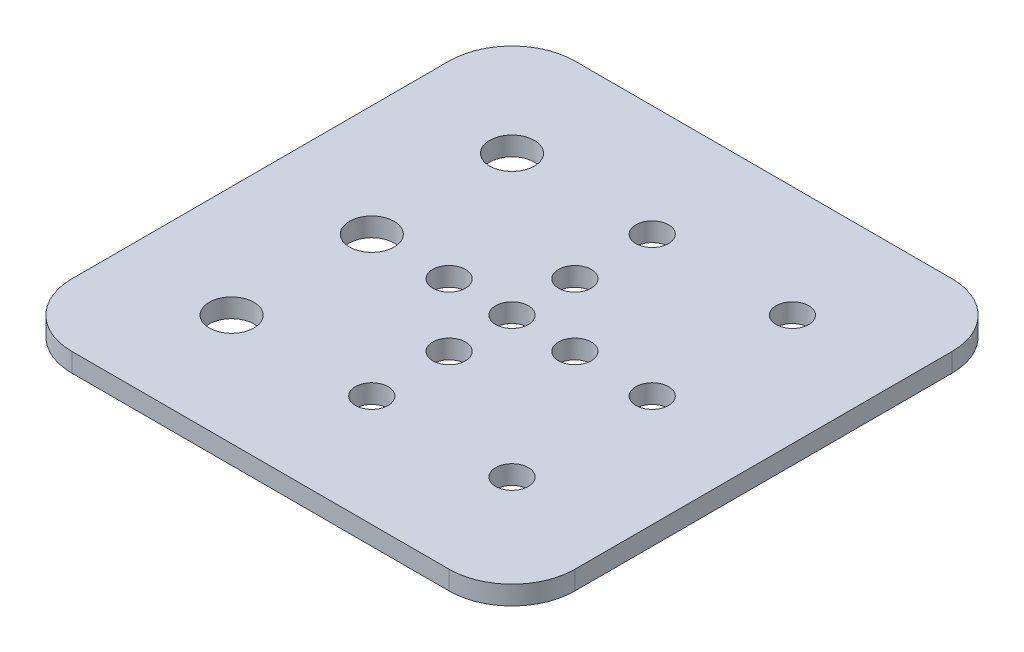
ISO-10303-21;
HEADER;
FILE_DESCRIPTION(('STEP AP214'),'2;1');
FILE_NAME('part.step','',(''),(''),'','','');
FILE_SCHEMA(('AUTOMOTIVE_DESIGN { 1 0 10303 214 1 1 1 1 }'));
ENDSEC;
DATA;
#1=APPLICATION_CONTEXT('core data for automotive mechanical design processes');
#2=APPLICATION_PROTOCOL_DEFINITION('international standard','automotive_design',2000,#1);
#3=PRODUCT_CONTEXT('',#1,'mechanical');
#4=PRODUCT('Part','Part','',(#3));
#5=PRODUCT_RELATED_PRODUCT_CATEGORY('part','',(#4));
#6=PRODUCT_DEFINITION_FORMATION('','',#4);
#7=PRODUCT_DEFINITION_CONTEXT('part definition',#1,'design');
#8=PRODUCT_DEFINITION('design','',#6,#7);
#9=PRODUCT_DEFINITION_SHAPE('','',#8);
#10=(LENGTH_UNIT() NAMED_UNIT(*) SI_UNIT(.MILLI.,.METRE.));
#11=(NAMED_UNIT(*) PLANE_ANGLE_UNIT() SI_UNIT($,.RADIAN.));
#12=(NAMED_UNIT(*) SI_UNIT($,.STERADIAN.) SOLID_ANGLE_UNIT());
#13=UNCERTAINTY_MEASURE_WITH_UNIT(LENGTH_MEASURE(1.E-05),#10,'distance_accuracy_value','');
#14=(GEOMETRIC_REPRESENTATION_CONTEXT(3) GLOBAL_UNCERTAINTY_ASSIGNED_CONTEXT((#13)) GLOBAL_UNIT_ASSIGNED_CONTEXT((#10,
#11,#12)) REPRESENTATION_CONTEXT('',''));
#15=CARTESIAN_POINT('',(0.,0.,0.));
#16=DIRECTION('',(0.,0.,1.));
#17=DIRECTION('',(1.,0.,0.));
#18=AXIS2_PLACEMENT_3D('',#15,#16,#17);
#19=CARTESIAN_POINT('',(-30.,3.,30.));
#20=DIRECTION('',(0.,-1.,0.));
#21=DIRECTION('',(0.,0.,-1.));
#22=AXIS2_PLACEMENT_3D('',#19,#20,#21);
#23=PLANE('',#22);
#24=CARTESIAN_POINT('',(22.3,3.,0.));
#25=DIRECTION('',(0.,1.,0.));
#26=DIRECTION('',(0.,0.,1.));
#27=AXIS2_PLACEMENT_3D('',#24,#25,#26);
#28=CIRCLE('',#27,2.6);
#29=CARTESIAN_POINT('',(22.3,3.,2.60000000000001));
#30=VERTEX_POINT('',#29);
#31=EDGE_CURVE('E244',#30,#30,#28,.T.);
#32=ORIENTED_EDGE('',*,*,#31,.F.);
#33=EDGE_LOOP('',(#32));
#34=FACE_BOUND('',#33,.T.);
#35=CARTESIAN_POINT('',(0.,3.,22.3));
#36=DIRECTION('',(0.,1.,0.));
#37=DIRECTION('',(0.,0.,-1.));
#38=AXIS2_PLACEMENT_3D('',#35,#36,#37);
#39=CIRCLE('',#38,2.6);
#40=CARTESIAN_POINT('',(0.,3.,19.7));
#41=VERTEX_POINT('',#40);
#42=EDGE_CURVE('E232',#41,#41,#39,.T.);
#43=ORIENTED_EDGE('',*,*,#42,.F.);
#44=EDGE_LOOP('',(#43));
#45=FACE_BOUND('',#44,.T.);
#46=CARTESIAN_POINT('',(-22.3,3.,22.3));
#47=DIRECTION('',(0.,1.,0.));
#48=DIRECTION('',(0.,0.,-1.));
#49=AXIS2_PLACEMENT_3D('',#46,#47,#48);
#50=CIRCLE('',#49,3.55);
#51=CARTESIAN_POINT('',(-22.3,3.,18.75));
#52=VERTEX_POINT('',#51);
#53=EDGE_CURVE('E220',#52,#52,#50,.T.);
#54=ORIENTED_EDGE('',*,*,#53,.F.);
#55=EDGE_LOOP('',(#54));
#56=FACE_BOUND('',#55,.T.);
#57=CARTESIAN_POINT('',(-22.3,3.,-22.3));
#58=DIRECTION('',(0.,1.,0.));
#59=DIRECTION('',(0.,0.,1.));
#60=AXIS2_PLACEMENT_3D('',#57,#58,#59);
#61=CIRCLE('',#60,3.55);
#62=CARTESIAN_POINT('',(-22.3,3.,-18.75));
#63=VERTEX_POINT('',#62);
#64=EDGE_CURVE('E208',#63,#63,#61,.T.);
#65=ORIENTED_EDGE('',*,*,#64,.F.);
#66=EDGE_LOOP('',(#65));
#67=FACE_BOUND('',#66,.T.);
#68=CARTESIAN_POINT('',(9.99999999999999,3.,0.));
#69=DIRECTION('',(0.,1.,0.));
#70=DIRECTION('',(0.,0.,-1.));
#71=AXIS2_PLACEMENT_3D('',#68,#69,#70);
#72=CIRCLE('',#71,2.6);
#73=CARTESIAN_POINT('',(9.99999999999999,3.,-2.60000000000001));
#74=VERTEX_POINT('',#73);
#75=EDGE_CURVE('E196',#74,#74,#72,.T.);
#76=ORIENTED_EDGE('',*,*,#75,.F.);
#77=EDGE_LOOP('',(#76));
#78=FACE_BOUND('',#77,.T.);
#79=CARTESIAN_POINT('',(0.,3.,10.));
#80=DIRECTION('',(0.,1.,0.));
#81=DIRECTION('',(0.,0.,1.));
#82=AXIS2_PLACEMENT_3D('',#79,#80,#81);
#83=CIRCLE('',#82,2.6);
#84=CARTESIAN_POINT('',(0.,3.,12.6));
#85=VERTEX_POINT('',#84);
#86=EDGE_CURVE('E184',#85,#85,#83,.T.);
#87=ORIENTED_EDGE('',*,*,#86,.F.);
#88=EDGE_LOOP('',(#87));
#89=FACE_BOUND('',#88,.T.);
#90=CARTESIAN_POINT('',(-30.,3.,30.));
#91=DIRECTION('',(0.,1.,0.));
#92=DIRECTION('',(0.,0.,-1.));
#93=AXIS2_PLACEMENT_3D('',#90,#91,#92);
#94=CIRCLE('',#93,10.);
#95=CARTESIAN_POINT('',(-40.,3.,29.9999999999999));
#96=VERTEX_POINT('',#95);
#97=CARTESIAN_POINT('',(-29.9999999999999,3.,40.));
#98=VERTEX_POINT('',#97);
#99=EDGE_CURVE('E147',#96,#98,#94,.T.);
#100=ORIENTED_EDGE('',*,*,#99,.T.);
#101=DIRECTION('',(1.,0.,0.));
#102=VECTOR('',#101,1.);
#103=CARTESIAN_POINT('',(29.9999999999999,3.,40.));
#104=LINE('',#103,#102);
#105=CARTESIAN_POINT('',(29.9999999999999,3.,40.));
#106=VERTEX_POINT('',#105);
#107=EDGE_CURVE('E95',#98,#106,#104,.T.);
#108=ORIENTED_EDGE('',*,*,#107,.T.);
#109=CARTESIAN_POINT('',(30.,3.,30.));
#110=DIRECTION('',(0.,1.,0.));
#111=DIRECTION('',(0.,0.,1.));
#112=AXIS2_PLACEMENT_3D('',#109,#110,#111);
#113=CIRCLE('',#112,10.);
#114=CARTESIAN_POINT('',(40.,3.,29.9999999999999));
#115=VERTEX_POINT('',#114);
#116=EDGE_CURVE('E162',#106,#115,#113,.T.);
#117=ORIENTED_EDGE('',*,*,#116,.T.);
#118=DIRECTION('',(0.,0.,-1.));
#119=VECTOR('',#118,1.);
#120=CARTESIAN_POINT('',(40.,3.,29.9999999999999));
#121=LINE('',#120,#119);
#122=CARTESIAN_POINT('',(40.,3.,-29.9999999999999));
#123=VERTEX_POINT('',#122);
#124=EDGE_CURVE('E175',#115,#123,#121,.T.);
#125=ORIENTED_EDGE('',*,*,#124,.T.);
#126=CARTESIAN_POINT('',(30.,3.,-30.));
#127=DIRECTION('',(0.,1.,0.));
#128=DIRECTION('',(0.,0.,1.));
#129=AXIS2_PLACEMENT_3D('',#126,#127,#128);
#130=CIRCLE('',#129,10.);
#131=CARTESIAN_POINT('',(29.9999999999999,3.,-40.));
#132=VERTEX_POINT('',#131);
#133=EDGE_CURVE('E114',#123,#132,#130,.T.);
#134=ORIENTED_EDGE('',*,*,#133,.T.);
#135=DIRECTION('',(-1.,0.,0.));
#136=VECTOR('',#135,1.);
#137=CARTESIAN_POINT('',(29.9999999999999,3.,-40.));
#138=LINE('',#137,#136);
#139=CARTESIAN_POINT('',(-29.9999999999999,3.,-40.));
#140=VERTEX_POINT('',#139);
#141=EDGE_CURVE('E108',#132,#140,#138,.T.);
#142=ORIENTED_EDGE('',*,*,#141,.T.);
#143=CARTESIAN_POINT('',(-30.,3.,-30.));
#144=DIRECTION('',(0.,1.,0.));
#145=DIRECTION('',(0.,0.,1.));
#146=AXIS2_PLACEMENT_3D('',#143,#144,#145);
#147=CIRCLE('',#146,10.);
#148=CARTESIAN_POINT('',(-40.,3.,-29.9999999999999));
#149=VERTEX_POINT('',#148);
#150=EDGE_CURVE('E112',#140,#149,#147,.T.);
#151=ORIENTED_EDGE('',*,*,#150,.T.);
#152=DIRECTION('',(0.,0.,1.));
#153=VECTOR('',#152,1.);
#154=CARTESIAN_POINT('',(-40.,3.,29.9999999999999));
#155=LINE('',#154,#153);
#156=EDGE_CURVE('E52',#149,#96,#155,.T.);
#157=ORIENTED_EDGE('',*,*,#156,.T.);
#158=EDGE_LOOP('',(#100,#108,#117,#125,#134,#142,#151,#157));
#159=FACE_BOUND('',#158,.T.);
#160=CARTESIAN_POINT('',(0.,3.,0.));
#161=DIRECTION('',(0.,1.,0.));
#162=DIRECTION('',(0.,0.,1.));
#163=AXIS2_PLACEMENT_3D('',#160,#161,#162);
#164=CIRCLE('',#163,2.6);
#165=CARTESIAN_POINT('',(0.,3.,2.60000000000001));
#166=VERTEX_POINT('',#165);
#167=EDGE_CURVE('E136',#166,#166,#164,.T.);
#168=ORIENTED_EDGE('',*,*,#167,.F.);
#169=EDGE_LOOP('',(#168));
#170=FACE_BOUND('',#169,.T.);
#171=CARTESIAN_POINT('',(-9.99999999999998,3.,0.));
#172=DIRECTION('',(0.,1.,0.));
#173=DIRECTION('',(0.,0.,-1.));
#174=AXIS2_PLACEMENT_3D('',#171,#172,#173);
#175=CIRCLE('',#174,2.6);
#176=CARTESIAN_POINT('',(-9.99999999999998,3.,-2.60000000000001));
#177=VERTEX_POINT('',#176);
#178=EDGE_CURVE('E190',#177,#177,#175,.T.);
#179=ORIENTED_EDGE('',*,*,#178,.F.);
#180=EDGE_LOOP('',(#179));
#181=FACE_BOUND('',#180,.T.);
#182=CARTESIAN_POINT('',(0.,3.,-9.99999999999998));
#183=DIRECTION('',(0.,1.,0.));
#184=DIRECTION('',(0.,0.,1.));
#185=AXIS2_PLACEMENT_3D('',#182,#183,#184);
#186=CIRCLE('',#185,2.6);
#187=CARTESIAN_POINT('',(0.,3.,-7.39999999999998));
#188=VERTEX_POINT('',#187);
#189=EDGE_CURVE('E202',#188,#188,#186,.T.);
#190=ORIENTED_EDGE('',*,*,#189,.F.);
#191=EDGE_LOOP('',(#190));
#192=FACE_BOUND('',#191,.T.);
#193=CARTESIAN_POINT('',(-22.3,3.,0.));
#194=DIRECTION('',(0.,1.,0.));
#195=DIRECTION('',(0.,0.,1.));
#196=AXIS2_PLACEMENT_3D('',#193,#194,#195);
#197=CIRCLE('',#196,3.55);
#198=CARTESIAN_POINT('',(-22.3,3.,3.55000000000001));
#199=VERTEX_POINT('',#198);
#200=EDGE_CURVE('E214',#199,#199,#197,.T.);
#201=ORIENTED_EDGE('',*,*,#200,.F.);
#202=EDGE_LOOP('',(#201));
#203=FACE_BOUND('',#202,.T.);
#204=CARTESIAN_POINT('',(0.,3.,-22.3));
#205=DIRECTION('',(0.,1.,0.));
#206=DIRECTION('',(0.,0.,1.));
#207=AXIS2_PLACEMENT_3D('',#204,#205,#206);
#208=CIRCLE('',#207,2.6);
#209=CARTESIAN_POINT('',(0.,3.,-19.7));
#210=VERTEX_POINT('',#209);
#211=EDGE_CURVE('E226',#210,#210,#208,.T.);
#212=ORIENTED_EDGE('',*,*,#211,.F.);
#213=EDGE_LOOP('',(#212));
#214=FACE_BOUND('',#213,.T.);
#215=CARTESIAN_POINT('',(22.3,3.,-22.3));
#216=DIRECTION('',(0.,1.,0.));
#217=DIRECTION('',(0.,0.,1.));
#218=AXIS2_PLACEMENT_3D('',#215,#216,#217);
#219=CIRCLE('',#218,2.6);
#220=CARTESIAN_POINT('',(22.3,3.,-19.7));
#221=VERTEX_POINT('',#220);
#222=EDGE_CURVE('E238',#221,#221,#219,.T.);
#223=ORIENTED_EDGE('',*,*,#222,.F.);
#224=EDGE_LOOP('',(#223));
#225=FACE_BOUND('',#224,.T.);
#226=CARTESIAN_POINT('',(22.3,3.,22.3));
#227=DIRECTION('',(0.,1.,0.));
#228=DIRECTION('',(0.,0.,-1.));
#229=AXIS2_PLACEMENT_3D('',#226,#227,#228);
#230=CIRCLE('',#229,2.6);
#231=CARTESIAN_POINT('',(22.3,3.,19.7));
#232=VERTEX_POINT('',#231);
#233=EDGE_CURVE('E250',#232,#232,#230,.T.);
#234=ORIENTED_EDGE('',*,*,#233,.F.);
#235=EDGE_LOOP('',(#234));
#236=FACE_BOUND('',#235,.T.);
#237=ADVANCED_FACE('F35',(#34,#45,#56,#67,#78,#89,#159,#170,#181,#192,#203,#214,#225,#236),#23,.F.);
#238=CARTESIAN_POINT('',(-30.,0.,30.));
#239=DIRECTION('',(0.,-1.,0.));
#240=DIRECTION('',(0.,0.,-1.));
#241=AXIS2_PLACEMENT_3D('',#238,#239,#240);
#242=PLANE('',#241);
#243=CARTESIAN_POINT('',(22.3,0.,0.));
#244=DIRECTION('',(0.,1.,0.));
#245=DIRECTION('',(0.,0.,1.));
#246=AXIS2_PLACEMENT_3D('',#243,#244,#245);
#247=CIRCLE('',#246,2.6);
#248=CARTESIAN_POINT('',(22.3,0.,2.60000000000001));
#249=VERTEX_POINT('',#248);
#250=EDGE_CURVE('E247',#249,#249,#247,.T.);
#251=ORIENTED_EDGE('',*,*,#250,.T.);
#252=EDGE_LOOP('',(#251));
#253=FACE_BOUND('',#252,.T.);
#254=CARTESIAN_POINT('',(0.,0.,22.3));
#255=DIRECTION('',(0.,1.,0.));
#256=DIRECTION('',(0.,0.,-1.));
#257=AXIS2_PLACEMENT_3D('',#254,#255,#256);
#258=CIRCLE('',#257,2.6);
#259=CARTESIAN_POINT('',(0.,0.,19.7));
#260=VERTEX_POINT('',#259);
#261=EDGE_CURVE('E235',#260,#260,#258,.T.);
#262=ORIENTED_EDGE('',*,*,#261,.T.);
#263=EDGE_LOOP('',(#262));
#264=FACE_BOUND('',#263,.T.);
#265=CARTESIAN_POINT('',(-22.3,0.,22.3));
#266=DIRECTION('',(0.,1.,0.));
#267=DIRECTION('',(0.,0.,-1.));
#268=AXIS2_PLACEMENT_3D('',#265,#266,#267);
#269=CIRCLE('',#268,3.55);
#270=CARTESIAN_POINT('',(-22.3,0.,18.75));
#271=VERTEX_POINT('',#270);
#272=EDGE_CURVE('E223',#271,#271,#269,.T.);
#273=ORIENTED_EDGE('',*,*,#272,.T.);
#274=EDGE_LOOP('',(#273));
#275=FACE_BOUND('',#274,.T.);
#276=CARTESIAN_POINT('',(-22.3,0.,-22.3));
#277=DIRECTION('',(0.,1.,0.));
#278=DIRECTION('',(0.,0.,1.));
#279=AXIS2_PLACEMENT_3D('',#276,#277,#278);
#280=CIRCLE('',#279,3.55);
#281=CARTESIAN_POINT('',(-22.3,0.,-18.75));
#282=VERTEX_POINT('',#281);
#283=EDGE_CURVE('E211',#282,#282,#280,.T.);
#284=ORIENTED_EDGE('',*,*,#283,.T.);
#285=EDGE_LOOP('',(#284));
#286=FACE_BOUND('',#285,.T.);
#287=CARTESIAN_POINT('',(9.99999999999999,0.,0.));
#288=DIRECTION('',(0.,1.,0.));
#289=DIRECTION('',(0.,0.,-1.));
#290=AXIS2_PLACEMENT_3D('',#287,#288,#289);
#291=CIRCLE('',#290,2.6);
#292=CARTESIAN_POINT('',(9.99999999999999,0.,-2.60000000000001));
#293=VERTEX_POINT('',#292);
#294=EDGE_CURVE('E199',#293,#293,#291,.T.);
#295=ORIENTED_EDGE('',*,*,#294,.T.);
#296=EDGE_LOOP('',(#295));
#297=FACE_BOUND('',#296,.T.);
#298=CARTESIAN_POINT('',(0.,0.,10.));
#299=DIRECTION('',(0.,1.,0.));
#300=DIRECTION('',(0.,0.,1.));
#301=AXIS2_PLACEMENT_3D('',#298,#299,#300);
#302=CIRCLE('',#301,2.6);
#303=CARTESIAN_POINT('',(0.,0.,12.6));
#304=VERTEX_POINT('',#303);
#305=EDGE_CURVE('E187',#304,#304,#302,.T.);
#306=ORIENTED_EDGE('',*,*,#305,.T.);
#307=EDGE_LOOP('',(#306));
#308=FACE_BOUND('',#307,.T.);
#309=CARTESIAN_POINT('',(-30.,0.,30.));
#310=DIRECTION('',(0.,1.,0.));
#311=DIRECTION('',(0.,0.,-1.));
#312=AXIS2_PLACEMENT_3D('',#309,#310,#311);
#313=CIRCLE('',#312,10.);
#314=CARTESIAN_POINT('',(-40.,0.,29.9999999999999));
#315=VERTEX_POINT('',#314);
#316=CARTESIAN_POINT('',(-29.9999999999999,0.,40.));
#317=VERTEX_POINT('',#316);
#318=EDGE_CURVE('E132',#315,#317,#313,.T.);
#319=ORIENTED_EDGE('',*,*,#318,.F.);
#320=DIRECTION('',(0.,0.,1.));
#321=VECTOR('',#320,1.);
#322=CARTESIAN_POINT('',(-40.,0.,29.9999999999999));
#323=LINE('',#322,#321);
#324=CARTESIAN_POINT('',(-40.,0.,-29.9999999999999));
#325=VERTEX_POINT('',#324);
#326=EDGE_CURVE('E87',#325,#315,#323,.T.);
#327=ORIENTED_EDGE('',*,*,#326,.F.);
#328=CARTESIAN_POINT('',(-30.,0.,-30.));
#329=DIRECTION('',(0.,1.,0.));
#330=DIRECTION('',(0.,0.,1.));
#331=AXIS2_PLACEMENT_3D('',#328,#329,#330);
#332=CIRCLE('',#331,10.);
#333=CARTESIAN_POINT('',(-29.9999999999999,0.,-40.));
#334=VERTEX_POINT('',#333);
#335=EDGE_CURVE('E81',#334,#325,#332,.T.);
#336=ORIENTED_EDGE('',*,*,#335,.F.);
#337=DIRECTION('',(-1.,0.,0.));
#338=VECTOR('',#337,1.);
#339=CARTESIAN_POINT('',(29.9999999999999,0.,-40.));
#340=LINE('',#339,#338);
#341=CARTESIAN_POINT('',(29.9999999999999,0.,-40.));
#342=VERTEX_POINT('',#341);
#343=EDGE_CURVE('E122',#342,#334,#340,.T.);
#344=ORIENTED_EDGE('',*,*,#343,.F.);
#345=CARTESIAN_POINT('',(30.,0.,-30.));
#346=DIRECTION('',(0.,1.,0.));
#347=DIRECTION('',(0.,0.,1.));
#348=AXIS2_PLACEMENT_3D('',#345,#346,#347);
#349=CIRCLE('',#348,10.);
#350=CARTESIAN_POINT('',(40.,0.,-29.9999999999999));
#351=VERTEX_POINT('',#350);
#352=EDGE_CURVE('E142',#351,#342,#349,.T.);
#353=ORIENTED_EDGE('',*,*,#352,.F.);
#354=DIRECTION('',(0.,0.,-1.));
#355=VECTOR('',#354,1.);
#356=CARTESIAN_POINT('',(40.,0.,29.9999999999999));
#357=LINE('',#356,#355);
#358=CARTESIAN_POINT('',(40.,0.,29.9999999999999));
#359=VERTEX_POINT('',#358);
#360=EDGE_CURVE('E140',#359,#351,#357,.T.);
#361=ORIENTED_EDGE('',*,*,#360,.F.);
#362=CARTESIAN_POINT('',(30.,0.,30.));
#363=DIRECTION('',(0.,1.,0.));
#364=DIRECTION('',(0.,0.,1.));
#365=AXIS2_PLACEMENT_3D('',#362,#363,#364);
#366=CIRCLE('',#365,10.);
#367=CARTESIAN_POINT('',(29.9999999999999,0.,40.));
#368=VERTEX_POINT('',#367);
#369=EDGE_CURVE('E138',#368,#359,#366,.T.);
#370=ORIENTED_EDGE('',*,*,#369,.F.);
#371=DIRECTION('',(1.,0.,0.));
#372=VECTOR('',#371,1.);
#373=CARTESIAN_POINT('',(29.9999999999999,0.,40.));
#374=LINE('',#373,#372);
#375=EDGE_CURVE('E135',#317,#368,#374,.T.);
#376=ORIENTED_EDGE('',*,*,#375,.F.);
#377=EDGE_LOOP('',(#319,#327,#336,#344,#353,#361,#370,#376));
#378=FACE_BOUND('',#377,.T.);
#379=CARTESIAN_POINT('',(0.,0.,0.));
#380=DIRECTION('',(0.,1.,0.));
#381=DIRECTION('',(0.,0.,1.));
#382=AXIS2_PLACEMENT_3D('',#379,#380,#381);
#383=CIRCLE('',#382,2.6);
#384=CARTESIAN_POINT('',(0.,0.,2.60000000000001));
#385=VERTEX_POINT('',#384);
#386=EDGE_CURVE('E181',#385,#385,#383,.T.);
#387=ORIENTED_EDGE('',*,*,#386,.T.);
#388=EDGE_LOOP('',(#387));
#389=FACE_BOUND('',#388,.T.);
#390=CARTESIAN_POINT('',(-9.99999999999998,0.,0.));
#391=DIRECTION('',(0.,1.,0.));
#392=DIRECTION('',(0.,0.,-1.));
#393=AXIS2_PLACEMENT_3D('',#390,#391,#392);
#394=CIRCLE('',#393,2.6);
#395=CARTESIAN_POINT('',(-9.99999999999998,0.,-2.60000000000001));
#396=VERTEX_POINT('',#395);
#397=EDGE_CURVE('E193',#396,#396,#394,.T.);
#398=ORIENTED_EDGE('',*,*,#397,.T.);
#399=EDGE_LOOP('',(#398));
#400=FACE_BOUND('',#399,.T.);
#401=CARTESIAN_POINT('',(0.,0.,-9.99999999999998));
#402=DIRECTION('',(0.,1.,0.));
#403=DIRECTION('',(0.,0.,1.));
#404=AXIS2_PLACEMENT_3D('',#401,#402,#403);
#405=CIRCLE('',#404,2.6);
#406=CARTESIAN_POINT('',(0.,0.,-7.39999999999998));
#407=VERTEX_POINT('',#406);
#408=EDGE_CURVE('E205',#407,#407,#405,.T.);
#409=ORIENTED_EDGE('',*,*,#408,.T.);
#410=EDGE_LOOP('',(#409));
#411=FACE_BOUND('',#410,.T.);
#412=CARTESIAN_POINT('',(-22.3,0.,0.));
#413=DIRECTION('',(0.,1.,0.));
#414=DIRECTION('',(0.,0.,1.));
#415=AXIS2_PLACEMENT_3D('',#412,#413,#414);
#416=CIRCLE('',#415,3.55);
#417=CARTESIAN_POINT('',(-22.3,0.,3.55000000000001));
#418=VERTEX_POINT('',#417);
#419=EDGE_CURVE('E217',#418,#418,#416,.T.);
#420=ORIENTED_EDGE('',*,*,#419,.T.);
#421=EDGE_LOOP('',(#420));
#422=FACE_BOUND('',#421,.T.);
#423=CARTESIAN_POINT('',(0.,0.,-22.3));
#424=DIRECTION('',(0.,1.,0.));
#425=DIRECTION('',(0.,0.,1.));
#426=AXIS2_PLACEMENT_3D('',#423,#424,#425);
#427=CIRCLE('',#426,2.6);
#428=CARTESIAN_POINT('',(0.,0.,-19.7));
#429=VERTEX_POINT('',#428);
#430=EDGE_CURVE('E229',#429,#429,#427,.T.);
#431=ORIENTED_EDGE('',*,*,#430,.T.);
#432=EDGE_LOOP('',(#431));
#433=FACE_BOUND('',#432,.T.);
#434=CARTESIAN_POINT('',(22.3,0.,-22.3));
#435=DIRECTION('',(0.,1.,0.));
#436=DIRECTION('',(0.,0.,1.));
#437=AXIS2_PLACEMENT_3D('',#434,#435,#436);
#438=CIRCLE('',#437,2.6);
#439=CARTESIAN_POINT('',(22.3,0.,-19.7));
#440=VERTEX_POINT('',#439);
#441=EDGE_CURVE('E241',#440,#440,#438,.T.);
#442=ORIENTED_EDGE('',*,*,#441,.T.);
#443=EDGE_LOOP('',(#442));
#444=FACE_BOUND('',#443,.T.);
#445=CARTESIAN_POINT('',(22.3,0.,22.3));
#446=DIRECTION('',(0.,1.,0.));
#447=DIRECTION('',(0.,0.,-1.));
#448=AXIS2_PLACEMENT_3D('',#445,#446,#447);
#449=CIRCLE('',#448,2.6);
#450=CARTESIAN_POINT('',(22.3,0.,19.7));
#451=VERTEX_POINT('',#450);
#452=EDGE_CURVE('E253',#451,#451,#449,.T.);
#453=ORIENTED_EDGE('',*,*,#452,.T.);
#454=EDGE_LOOP('',(#453));
#455=FACE_BOUND('',#454,.T.);
#456=ADVANCED_FACE('F166',(#253,#264,#275,#286,#297,#308,#378,#389,#400,#411,#422,#433,#444,
#455),#242,.T.);
#457=CARTESIAN_POINT('',(-30.,3.,30.));
#458=DIRECTION('',(0.,-1.,0.));
#459=DIRECTION('',(0.,0.,-1.));
#460=AXIS2_PLACEMENT_3D('',#457,#458,#459);
#461=CYLINDRICAL_SURFACE('',#460,10.);
#462=ORIENTED_EDGE('',*,*,#318,.T.);
#463=DIRECTION('',(0.,-1.,0.));
#464=VECTOR('',#463,1.);
#465=CARTESIAN_POINT('',(-29.9999999999999,3.,40.));
#466=LINE('',#465,#464);
#467=EDGE_CURVE('E11',#98,#317,#466,.T.);
#468=ORIENTED_EDGE('',*,*,#467,.F.);
#469=ORIENTED_EDGE('',*,*,#99,.F.);
#470=DIRECTION('',(0.,-1.,0.));
#471=VECTOR('',#470,1.);
#472=CARTESIAN_POINT('',(-40.,3.,29.9999999999999));
#473=LINE('',#472,#471);
#474=EDGE_CURVE('E128',#96,#315,#473,.T.);
#475=ORIENTED_EDGE('',*,*,#474,.T.);
#476=EDGE_LOOP('',(#462,#468,#469,#475));
#477=FACE_BOUND('',#476,.T.);
#478=ADVANCED_FACE('F37',(#477),#461,.T.);
#479=CARTESIAN_POINT('',(29.9999999999999,3.,40.));
#480=DIRECTION('',(0.,0.,-1.));
#481=DIRECTION('',(-1.,0.,0.));
#482=AXIS2_PLACEMENT_3D('',#479,#480,#481);
#483=PLANE('',#482);
#484=ORIENTED_EDGE('',*,*,#375,.T.);
#485=DIRECTION('',(0.,-1.,0.));
#486=VECTOR('',#485,1.);
#487=CARTESIAN_POINT('',(29.9999999999999,3.,40.));
#488=LINE('',#487,#486);
#489=EDGE_CURVE('E44',#106,#368,#488,.T.);
#490=ORIENTED_EDGE('',*,*,#489,.F.);
#491=ORIENTED_EDGE('',*,*,#107,.F.);
#492=ORIENTED_EDGE('',*,*,#467,.T.);
#493=EDGE_LOOP('',(#484,#490,#491,#492));
#494=FACE_BOUND('',#493,.T.);
#495=ADVANCED_FACE('F288',(#494),#483,.F.);
#496=CARTESIAN_POINT('',(30.,3.,30.));
#497=DIRECTION('',(0.,-1.,0.));
#498=DIRECTION('',(0.,0.,-1.));
#499=AXIS2_PLACEMENT_3D('',#496,#497,#498);
#500=CYLINDRICAL_SURFACE('',#499,10.);
#501=ORIENTED_EDGE('',*,*,#369,.T.);
#502=DIRECTION('',(0.,-1.,0.));
#503=VECTOR('',#502,1.);
#504=CARTESIAN_POINT('',(40.,3.,29.9999999999999));
#505=LINE('',#504,#503);
#506=EDGE_CURVE('E154',#115,#359,#505,.T.);
#507=ORIENTED_EDGE('',*,*,#506,.F.);
#508=ORIENTED_EDGE('',*,*,#116,.F.);
#509=ORIENTED_EDGE('',*,*,#489,.T.);
#510=EDGE_LOOP('',(#501,#507,#508,#509));
#511=FACE_BOUND('',#510,.T.);
#512=ADVANCED_FACE('F160',(#511),#500,.T.);
#513=CARTESIAN_POINT('',(40.,3.,29.9999999999999));
#514=DIRECTION('',(-1.,0.,0.));
#515=DIRECTION('',(0.,0.,1.));
#516=AXIS2_PLACEMENT_3D('',#513,#514,#515);
#517=PLANE('',#516);
#518=ORIENTED_EDGE('',*,*,#360,.T.);
#519=DIRECTION('',(0.,-1.,0.));
#520=VECTOR('',#519,1.);
#521=CARTESIAN_POINT('',(40.,3.,-29.9999999999999));
#522=LINE('',#521,#520);
#523=EDGE_CURVE('E151',#123,#351,#522,.T.);
#524=ORIENTED_EDGE('',*,*,#523,.F.);
#525=ORIENTED_EDGE('',*,*,#124,.F.);
#526=ORIENTED_EDGE('',*,*,#506,.T.);
#527=EDGE_LOOP('',(#518,#524,#525,#526));
#528=FACE_BOUND('',#527,.T.);
#529=ADVANCED_FACE('F171',(#528),#517,.F.);
#530=CARTESIAN_POINT('',(30.,3.,-30.));
#531=DIRECTION('',(0.,-1.,0.));
#532=DIRECTION('',(0.,0.,-1.));
#533=AXIS2_PLACEMENT_3D('',#530,#531,#532);
#534=CYLINDRICAL_SURFACE('',#533,10.);
#535=ORIENTED_EDGE('',*,*,#352,.T.);
#536=DIRECTION('',(0.,-1.,0.));
#537=VECTOR('',#536,1.);
#538=CARTESIAN_POINT('',(29.9999999999999,3.,-40.));
#539=LINE('',#538,#537);
#540=EDGE_CURVE('E123',#132,#342,#539,.T.);
#541=ORIENTED_EDGE('',*,*,#540,.F.);
#542=ORIENTED_EDGE('',*,*,#133,.F.);
#543=ORIENTED_EDGE('',*,*,#523,.T.);
#544=EDGE_LOOP('',(#535,#541,#542,#543));
#545=FACE_BOUND('',#544,.T.);
#546=ADVANCED_FACE('F174',(#545),#534,.T.);
#547=CARTESIAN_POINT('',(29.9999999999999,3.,-40.));
#548=DIRECTION('',(0.,0.,1.));
#549=DIRECTION('',(1.,0.,0.));
#550=AXIS2_PLACEMENT_3D('',#547,#548,#549);
#551=PLANE('',#550);
#552=ORIENTED_EDGE('',*,*,#343,.T.);
#553=DIRECTION('',(0.,-1.,0.));
#554=VECTOR('',#553,1.);
#555=CARTESIAN_POINT('',(-29.9999999999999,3.,-40.));
#556=LINE('',#555,#554);
#557=EDGE_CURVE('E119',#140,#334,#556,.T.);
#558=ORIENTED_EDGE('',*,*,#557,.F.);
#559=ORIENTED_EDGE('',*,*,#141,.F.);
#560=ORIENTED_EDGE('',*,*,#540,.T.);
#561=EDGE_LOOP('',(#552,#558,#559,#560));
#562=FACE_BOUND('',#561,.T.);
#563=ADVANCED_FACE('F120',(#562),#551,.F.);
#564=CARTESIAN_POINT('',(-30.,3.,-30.));
#565=DIRECTION('',(0.,-1.,0.));
#566=DIRECTION('',(0.,0.,-1.));
#567=AXIS2_PLACEMENT_3D('',#564,#565,#566);
#568=CYLINDRICAL_SURFACE('',#567,10.);
#569=ORIENTED_EDGE('',*,*,#335,.T.);
#570=DIRECTION('',(0.,-1.,0.));
#571=VECTOR('',#570,1.);
#572=CARTESIAN_POINT('',(-40.,3.,-29.9999999999999));
#573=LINE('',#572,#571);
#574=EDGE_CURVE('E124',#149,#325,#573,.T.);
#575=ORIENTED_EDGE('',*,*,#574,.F.);
#576=ORIENTED_EDGE('',*,*,#150,.F.);
#577=ORIENTED_EDGE('',*,*,#557,.T.);
#578=EDGE_LOOP('',(#569,#575,#576,#577));
#579=FACE_BOUND('',#578,.T.);
#580=ADVANCED_FACE('F126',(#579),#568,.T.);
#581=CARTESIAN_POINT('',(-40.,3.,29.9999999999999));
#582=DIRECTION('',(1.,0.,0.));
#583=DIRECTION('',(0.,0.,-1.));
#584=AXIS2_PLACEMENT_3D('',#581,#582,#583);
#585=PLANE('',#584);
#586=ORIENTED_EDGE('',*,*,#326,.T.);
#587=ORIENTED_EDGE('',*,*,#474,.F.);
#588=ORIENTED_EDGE('',*,*,#156,.F.);
#589=ORIENTED_EDGE('',*,*,#574,.T.);
#590=EDGE_LOOP('',(#586,#587,#588,#589));
#591=FACE_BOUND('',#590,.T.);
#592=ADVANCED_FACE('F276',(#591),#585,.F.);
#593=CARTESIAN_POINT('',(0.,3.,0.));
#594=DIRECTION('',(0.,-1.,0.));
#595=DIRECTION('',(0.,0.,-1.));
#596=AXIS2_PLACEMENT_3D('',#593,#594,#595);
#597=CYLINDRICAL_SURFACE('',#596,2.6);
#598=ORIENTED_EDGE('',*,*,#167,.T.);
#599=EDGE_LOOP('',(#598));
#600=FACE_BOUND('',#599,.T.);
#601=ORIENTED_EDGE('',*,*,#386,.F.);
#602=EDGE_LOOP('',(#601));
#603=FACE_BOUND('',#602,.T.);
#604=ADVANCED_FACE('F273',(#600,#603),#597,.F.);
#605=CARTESIAN_POINT('',(0.,3.,10.));
#606=DIRECTION('',(0.,-1.,0.));
#607=DIRECTION('',(0.,0.,-1.));
#608=AXIS2_PLACEMENT_3D('',#605,#606,#607);
#609=CYLINDRICAL_SURFACE('',#608,2.6);
#610=ORIENTED_EDGE('',*,*,#86,.T.);
#611=EDGE_LOOP('',(#610));
#612=FACE_BOUND('',#611,.T.);
#613=ORIENTED_EDGE('',*,*,#305,.F.);
#614=EDGE_LOOP('',(#613));
#615=FACE_BOUND('',#614,.T.);
#616=ADVANCED_FACE('F352',(#612,#615),#609,.F.);
#617=CARTESIAN_POINT('',(-9.99999999999998,3.,0.));
#618=DIRECTION('',(0.,-1.,0.));
#619=DIRECTION('',(0.,0.,-1.));
#620=AXIS2_PLACEMENT_3D('',#617,#618,#619);
#621=CYLINDRICAL_SURFACE('',#620,2.6);
#622=ORIENTED_EDGE('',*,*,#178,.T.);
#623=EDGE_LOOP('',(#622));
#624=FACE_BOUND('',#623,.T.);
#625=ORIENTED_EDGE('',*,*,#397,.F.);
#626=EDGE_LOOP('',(#625));
#627=FACE_BOUND('',#626,.T.);
#628=ADVANCED_FACE('F360',(#624,#627),#621,.F.);
#629=CARTESIAN_POINT('',(9.99999999999999,3.,0.));
#630=DIRECTION('',(0.,-1.,0.));
#631=DIRECTION('',(0.,0.,-1.));
#632=AXIS2_PLACEMENT_3D('',#629,#630,#631);
#633=CYLINDRICAL_SURFACE('',#632,2.6);
#634=ORIENTED_EDGE('',*,*,#75,.T.);
#635=EDGE_LOOP('',(#634));
#636=FACE_BOUND('',#635,.T.);
#637=ORIENTED_EDGE('',*,*,#294,.F.);
#638=EDGE_LOOP('',(#637));
#639=FACE_BOUND('',#638,.T.);
#640=ADVANCED_FACE('F368',(#636,#639),#633,.F.);
#641=CARTESIAN_POINT('',(0.,3.,-9.99999999999998));
#642=DIRECTION('',(0.,-1.,0.));
#643=DIRECTION('',(0.,0.,-1.));
#644=AXIS2_PLACEMENT_3D('',#641,#642,#643);
#645=CYLINDRICAL_SURFACE('',#644,2.6);
#646=ORIENTED_EDGE('',*,*,#189,.T.);
#647=EDGE_LOOP('',(#646));
#648=FACE_BOUND('',#647,.T.);
#649=ORIENTED_EDGE('',*,*,#408,.F.);
#650=EDGE_LOOP('',(#649));
#651=FACE_BOUND('',#650,.T.);
#652=ADVANCED_FACE('F377',(#648,#651),#645,.F.);
#653=CARTESIAN_POINT('',(-22.3,3.,-22.3));
#654=DIRECTION('',(0.,-1.,0.));
#655=DIRECTION('',(0.,0.,-1.));
#656=AXIS2_PLACEMENT_3D('',#653,#654,#655);
#657=CYLINDRICAL_SURFACE('',#656,3.55);
#658=ORIENTED_EDGE('',*,*,#64,.T.);
#659=EDGE_LOOP('',(#658));
#660=FACE_BOUND('',#659,.T.);
#661=ORIENTED_EDGE('',*,*,#283,.F.);
#662=EDGE_LOOP('',(#661));
#663=FACE_BOUND('',#662,.T.);
#664=ADVANCED_FACE('F386',(#660,#663),#657,.F.);
#665=CARTESIAN_POINT('',(-22.3,3.,0.));
#666=DIRECTION('',(0.,-1.,0.));
#667=DIRECTION('',(0.,0.,-1.));
#668=AXIS2_PLACEMENT_3D('',#665,#666,#667);
#669=CYLINDRICAL_SURFACE('',#668,3.55);
#670=ORIENTED_EDGE('',*,*,#200,.T.);
#671=EDGE_LOOP('',(#670));
#672=FACE_BOUND('',#671,.T.);
#673=ORIENTED_EDGE('',*,*,#419,.F.);
#674=EDGE_LOOP('',(#673));
#675=FACE_BOUND('',#674,.T.);
#676=ADVANCED_FACE('F395',(#672,#675),#669,.F.);
#677=CARTESIAN_POINT('',(-22.3,3.,22.3));
#678=DIRECTION('',(0.,-1.,0.));
#679=DIRECTION('',(0.,0.,-1.));
#680=AXIS2_PLACEMENT_3D('',#677,#678,#679);
#681=CYLINDRICAL_SURFACE('',#680,3.55);
#682=ORIENTED_EDGE('',*,*,#53,.T.);
#683=EDGE_LOOP('',(#682));
#684=FACE_BOUND('',#683,.T.);
#685=ORIENTED_EDGE('',*,*,#272,.F.);
#686=EDGE_LOOP('',(#685));
#687=FACE_BOUND('',#686,.T.);
#688=ADVANCED_FACE('F404',(#684,#687),#681,.F.);
#689=CARTESIAN_POINT('',(0.,3.,-22.3));
#690=DIRECTION('',(0.,-1.,0.));
#691=DIRECTION('',(0.,0.,-1.));
#692=AXIS2_PLACEMENT_3D('',#689,#690,#691);
#693=CYLINDRICAL_SURFACE('',#692,2.6);
#694=ORIENTED_EDGE('',*,*,#211,.T.);
#695=EDGE_LOOP('',(#694));
#696=FACE_BOUND('',#695,.T.);
#697=ORIENTED_EDGE('',*,*,#430,.F.);
#698=EDGE_LOOP('',(#697));
#699=FACE_BOUND('',#698,.T.);
#700=ADVANCED_FACE('F413',(#696,#699),#693,.F.);
#701=CARTESIAN_POINT('',(0.,3.,22.3));
#702=DIRECTION('',(0.,-1.,0.));
#703=DIRECTION('',(0.,0.,-1.));
#704=AXIS2_PLACEMENT_3D('',#701,#702,#703);
#705=CYLINDRICAL_SURFACE('',#704,2.6);
#706=ORIENTED_EDGE('',*,*,#42,.T.);
#707=EDGE_LOOP('',(#706));
#708=FACE_BOUND('',#707,.T.);
#709=ORIENTED_EDGE('',*,*,#261,.F.);
#710=EDGE_LOOP('',(#709));
#711=FACE_BOUND('',#710,.T.);
#712=ADVANCED_FACE('F422',(#708,#711),#705,.F.);
#713=CARTESIAN_POINT('',(22.3,3.,-22.3));
#714=DIRECTION('',(0.,-1.,0.));
#715=DIRECTION('',(0.,0.,-1.));
#716=AXIS2_PLACEMENT_3D('',#713,#714,#715);
#717=CYLINDRICAL_SURFACE('',#716,2.6);
#718=ORIENTED_EDGE('',*,*,#222,.T.);
#719=EDGE_LOOP('',(#718));
#720=FACE_BOUND('',#719,.T.);
#721=ORIENTED_EDGE('',*,*,#441,.F.);
#722=EDGE_LOOP('',(#721));
#723=FACE_BOUND('',#722,.T.);
#724=ADVANCED_FACE('F431',(#720,#723),#717,.F.);
#725=CARTESIAN_POINT('',(22.3,3.,0.));
#726=DIRECTION('',(0.,-1.,0.));
#727=DIRECTION('',(0.,0.,-1.));
#728=AXIS2_PLACEMENT_3D('',#725,#726,#727);
#729=CYLINDRICAL_SURFACE('',#728,2.6);
#730=ORIENTED_EDGE('',*,*,#31,.T.);
#731=EDGE_LOOP('',(#730));
#732=FACE_BOUND('',#731,.T.);
#733=ORIENTED_EDGE('',*,*,#250,.F.);
#734=EDGE_LOOP('',(#733));
#735=FACE_BOUND('',#734,.T.);
#736=ADVANCED_FACE('F440',(#732,#735),#729,.F.);
#737=CARTESIAN_POINT('',(22.3,3.,22.3));
#738=DIRECTION('',(0.,-1.,0.));
#739=DIRECTION('',(0.,0.,-1.));
#740=AXIS2_PLACEMENT_3D('',#737,#738,#739);
#741=CYLINDRICAL_SURFACE('',#740,2.6);
#742=ORIENTED_EDGE('',*,*,#233,.T.);
#743=EDGE_LOOP('',(#742));
#744=FACE_BOUND('',#743,.T.);
#745=ORIENTED_EDGE('',*,*,#452,.F.);
#746=EDGE_LOOP('',(#745));
#747=FACE_BOUND('',#746,.T.);
#748=ADVANCED_FACE('F259',(#744,#747),#741,.F.);
#749=CLOSED_SHELL('',(#237,#456,#478,#495,#512,#529,#546,#563,#580,#592,#604,#616,#628,#640,
#652,#664,#676,#688,#700,#712,#724,#736,#748));
#750=MANIFOLD_SOLID_BREP('B2',#749);
#751=ADVANCED_BREP_SHAPE_REPRESENTATION('',(#18,#750),#14);
#752=SHAPE_DEFINITION_REPRESENTATION(#9,#751);
ENDSEC;
END-ISO-10303-21;
